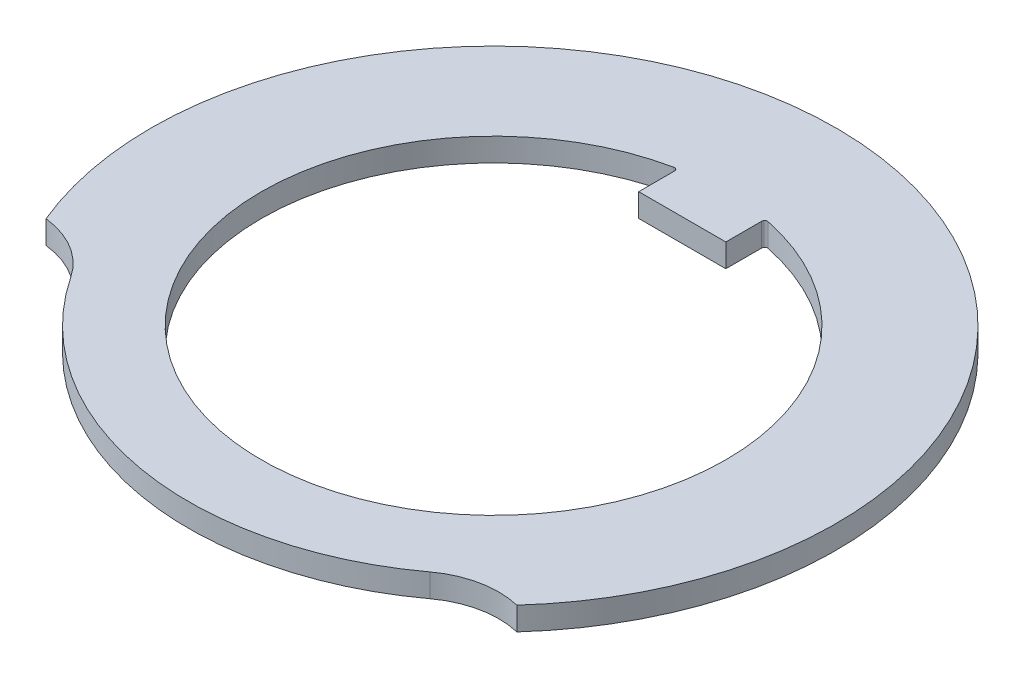
ISO-10303-21;
HEADER;
FILE_DESCRIPTION(('STEP AP214'),'2;1');
FILE_NAME('part.step','',(''),(''),'','','');
FILE_SCHEMA(('AUTOMOTIVE_DESIGN { 1 0 10303 214 1 1 1 1 }'));
ENDSEC;
DATA;
#1=APPLICATION_CONTEXT('core data for automotive mechanical design processes');
#2=APPLICATION_PROTOCOL_DEFINITION('international standard','automotive_design',2000,#1);
#3=PRODUCT_CONTEXT('',#1,'mechanical');
#4=PRODUCT('Part','Part','',(#3));
#5=PRODUCT_RELATED_PRODUCT_CATEGORY('part','',(#4));
#6=PRODUCT_DEFINITION_FORMATION('','',#4);
#7=PRODUCT_DEFINITION_CONTEXT('part definition',#1,'design');
#8=PRODUCT_DEFINITION('design','',#6,#7);
#9=PRODUCT_DEFINITION_SHAPE('','',#8);
#10=(LENGTH_UNIT() NAMED_UNIT(*) SI_UNIT(.MILLI.,.METRE.));
#11=(NAMED_UNIT(*) PLANE_ANGLE_UNIT() SI_UNIT($,.RADIAN.));
#12=(NAMED_UNIT(*) SI_UNIT($,.STERADIAN.) SOLID_ANGLE_UNIT());
#13=UNCERTAINTY_MEASURE_WITH_UNIT(LENGTH_MEASURE(1.E-05),#10,'distance_accuracy_value','');
#14=(GEOMETRIC_REPRESENTATION_CONTEXT(3) GLOBAL_UNCERTAINTY_ASSIGNED_CONTEXT((#13)) GLOBAL_UNIT_ASSIGNED_CONTEXT((#10,
#11,#12)) REPRESENTATION_CONTEXT('',''));
#15=CARTESIAN_POINT('',(0.,0.,0.));
#16=DIRECTION('',(0.,0.,1.));
#17=DIRECTION('',(1.,0.,0.));
#18=AXIS2_PLACEMENT_3D('',#15,#16,#17);
#19=CARTESIAN_POINT('',(4.01608518306673,0.8,5.42527048195312));
#20=DIRECTION('',(0.,-1.,0.));
#21=DIRECTION('',(0.,0.,-1.));
#22=AXIS2_PLACEMENT_3D('',#19,#20,#21);
#23=PLANE('',#22);
#24=CARTESIAN_POINT('',(8.03217036613347,0.8,10.8505409639062));
#25=DIRECTION('',(0.,-1.,0.));
#26=DIRECTION('',(0.,0.,-1.));
#27=AXIS2_PLACEMENT_3D('',#24,#25,#26);
#28=CIRCLE('',#27,3.);
#29=CARTESIAN_POINT('',(6.24724361810381,0.8,8.43930963859375));
#30=VERTEX_POINT('',#29);
#31=CARTESIAN_POINT('',(8.73457390434464,0.8,7.93392832772906));
#32=VERTEX_POINT('',#31);
#33=EDGE_CURVE('E149',#30,#32,#28,.T.);
#34=ORIENTED_EDGE('',*,*,#33,.T.);
#35=CARTESIAN_POINT('',(0.,0.8,0.));
#36=DIRECTION('',(0.,1.,0.));
#37=DIRECTION('',(0.,0.,1.));
#38=AXIS2_PLACEMENT_3D('',#35,#36,#37);
#39=CIRCLE('',#38,11.8);
#40=CARTESIAN_POINT('',(-10.9017784836332,0.8,4.51566450190802));
#41=VERTEX_POINT('',#40);
#42=EDGE_CURVE('E152',#32,#41,#39,.T.);
#43=ORIENTED_EDGE('',*,*,#42,.T.);
#44=CARTESIAN_POINT('',(-11.2262652901416,0.8,7.49806425921791));
#45=DIRECTION('',(0.,-1.,0.));
#46=DIRECTION('',(0.,0.,-1.));
#47=AXIS2_PLACEMENT_3D('',#44,#45,#46);
#48=CIRCLE('',#47,3.);
#49=CARTESIAN_POINT('',(-8.73153967011016,0.8,5.83182775716948));
#50=VERTEX_POINT('',#49);
#51=EDGE_CURVE('E155',#41,#50,#48,.T.);
#52=ORIENTED_EDGE('',*,*,#51,.T.);
#53=CARTESIAN_POINT('',(0.,0.8,0.));
#54=DIRECTION('',(0.,1.,0.));
#55=DIRECTION('',(0.,0.,1.));
#56=AXIS2_PLACEMENT_3D('',#53,#54,#55);
#57=CIRCLE('',#56,10.5);
#58=EDGE_CURVE('E157',#50,#30,#57,.T.);
#59=ORIENTED_EDGE('',*,*,#58,.T.);
#60=EDGE_LOOP('',(#34,#43,#52,#59));
#61=FACE_BOUND('',#60,.T.);
#62=DIRECTION('',(0.,0.,-1.));
#63=VECTOR('',#62,1.);
#64=CARTESIAN_POINT('',(-1.5,0.8,-6.5));
#65=LINE('',#64,#63);
#66=CARTESIAN_POINT('',(-1.5,0.8,-6.5));
#67=VERTEX_POINT('',#66);
#68=CARTESIAN_POINT('',(-1.5,0.8,-7.73627817493658));
#69=VERTEX_POINT('',#68);
#70=EDGE_CURVE('E126',#67,#69,#65,.T.);
#71=ORIENTED_EDGE('',*,*,#70,.F.);
#72=DIRECTION('',(-1.,0.,0.));
#73=VECTOR('',#72,1.);
#74=CARTESIAN_POINT('',(-1.5,0.8,-6.5));
#75=LINE('',#74,#73);
#76=CARTESIAN_POINT('',(1.5,0.8,-6.5));
#77=VERTEX_POINT('',#76);
#78=EDGE_CURVE('E110',#77,#67,#75,.T.);
#79=ORIENTED_EDGE('',*,*,#78,.F.);
#80=DIRECTION('',(0.,0.,1.));
#81=VECTOR('',#80,1.);
#82=CARTESIAN_POINT('',(1.5,0.8,-6.5));
#83=LINE('',#82,#81);
#84=CARTESIAN_POINT('',(1.5,0.8,-7.73627817493658));
#85=VERTEX_POINT('',#84);
#86=EDGE_CURVE('E120',#85,#77,#83,.T.);
#87=ORIENTED_EDGE('',*,*,#86,.F.);
#88=CARTESIAN_POINT('',(1.6,0.8,-7.73627817493658));
#89=DIRECTION('',(0.,-1.,0.));
#90=DIRECTION('',(0.,0.,-1.));
#91=AXIS2_PLACEMENT_3D('',#88,#89,#90);
#92=CIRCLE('',#91,0.1);
#93=CARTESIAN_POINT('',(1.62025316455696,0.8,-7.83420574677122));
#94=VERTEX_POINT('',#93);
#95=EDGE_CURVE('E11',#85,#94,#92,.T.);
#96=ORIENTED_EDGE('',*,*,#95,.T.);
#97=CARTESIAN_POINT('',(0.,0.8,0.));
#98=DIRECTION('',(0.,1.,0.));
#99=DIRECTION('',(0.,0.,1.));
#100=AXIS2_PLACEMENT_3D('',#97,#98,#99);
#101=CIRCLE('',#100,8.);
#102=CARTESIAN_POINT('',(-1.62025316455696,0.8,-7.83420574677122));
#103=VERTEX_POINT('',#102);
#104=EDGE_CURVE('E134',#103,#94,#101,.T.);
#105=ORIENTED_EDGE('',*,*,#104,.F.);
#106=CARTESIAN_POINT('',(-1.6,0.8,-7.73627817493658));
#107=DIRECTION('',(0.,-1.,0.));
#108=DIRECTION('',(0.,0.,-1.));
#109=AXIS2_PLACEMENT_3D('',#106,#107,#108);
#110=CIRCLE('',#109,0.1);
#111=EDGE_CURVE('E133',#103,#69,#110,.T.);
#112=ORIENTED_EDGE('',*,*,#111,.T.);
#113=EDGE_LOOP('',(#71,#79,#87,#96,#105,#112));
#114=FACE_BOUND('',#113,.T.);
#115=ADVANCED_FACE('F34',(#61,#114),#23,.F.);
#116=CARTESIAN_POINT('',(4.01608518306673,0.,5.42527048195312));
#117=DIRECTION('',(0.,-1.,0.));
#118=DIRECTION('',(0.,0.,-1.));
#119=AXIS2_PLACEMENT_3D('',#116,#117,#118);
#120=PLANE('',#119);
#121=CARTESIAN_POINT('',(8.03217036613347,0.,10.8505409639062));
#122=DIRECTION('',(0.,-1.,0.));
#123=DIRECTION('',(0.,0.,-1.));
#124=AXIS2_PLACEMENT_3D('',#121,#122,#123);
#125=CIRCLE('',#124,3.);
#126=CARTESIAN_POINT('',(6.24724361810381,0.,8.43930963859375));
#127=VERTEX_POINT('',#126);
#128=CARTESIAN_POINT('',(8.73457390434464,0.,7.93392832772906));
#129=VERTEX_POINT('',#128);
#130=EDGE_CURVE('E148',#127,#129,#125,.T.);
#131=ORIENTED_EDGE('',*,*,#130,.F.);
#132=CARTESIAN_POINT('',(0.,0.,0.));
#133=DIRECTION('',(0.,1.,0.));
#134=DIRECTION('',(0.,0.,1.));
#135=AXIS2_PLACEMENT_3D('',#132,#133,#134);
#136=CIRCLE('',#135,10.5);
#137=CARTESIAN_POINT('',(-8.73153967011016,0.,5.83182775716948));
#138=VERTEX_POINT('',#137);
#139=EDGE_CURVE('E153',#138,#127,#136,.T.);
#140=ORIENTED_EDGE('',*,*,#139,.F.);
#141=CARTESIAN_POINT('',(-11.2262652901416,0.,7.49806425921791));
#142=DIRECTION('',(0.,-1.,0.));
#143=DIRECTION('',(0.,0.,-1.));
#144=AXIS2_PLACEMENT_3D('',#141,#142,#143);
#145=CIRCLE('',#144,3.);
#146=CARTESIAN_POINT('',(-10.9017784836332,0.,4.51566450190802));
#147=VERTEX_POINT('',#146);
#148=EDGE_CURVE('E164',#147,#138,#145,.T.);
#149=ORIENTED_EDGE('',*,*,#148,.F.);
#150=CARTESIAN_POINT('',(0.,0.,0.));
#151=DIRECTION('',(0.,1.,0.));
#152=DIRECTION('',(0.,0.,1.));
#153=AXIS2_PLACEMENT_3D('',#150,#151,#152);
#154=CIRCLE('',#153,11.8);
#155=EDGE_CURVE('E162',#129,#147,#154,.T.);
#156=ORIENTED_EDGE('',*,*,#155,.F.);
#157=EDGE_LOOP('',(#131,#140,#149,#156));
#158=FACE_BOUND('',#157,.T.);
#159=DIRECTION('',(-1.,0.,0.));
#160=VECTOR('',#159,1.);
#161=CARTESIAN_POINT('',(-1.5,0.,-6.5));
#162=LINE('',#161,#160);
#163=CARTESIAN_POINT('',(1.5,0.,-6.5));
#164=VERTEX_POINT('',#163);
#165=CARTESIAN_POINT('',(-1.5,0.,-6.5));
#166=VERTEX_POINT('',#165);
#167=EDGE_CURVE('E135',#164,#166,#162,.T.);
#168=ORIENTED_EDGE('',*,*,#167,.T.);
#169=DIRECTION('',(0.,0.,-1.));
#170=VECTOR('',#169,1.);
#171=CARTESIAN_POINT('',(-1.5,0.,-6.5));
#172=LINE('',#171,#170);
#173=CARTESIAN_POINT('',(-1.5,0.,-7.73627817493658));
#174=VERTEX_POINT('',#173);
#175=EDGE_CURVE('E129',#166,#174,#172,.T.);
#176=ORIENTED_EDGE('',*,*,#175,.T.);
#177=CARTESIAN_POINT('',(-1.6,0.,-7.73627817493658));
#178=DIRECTION('',(0.,-1.,0.));
#179=DIRECTION('',(0.,0.,-1.));
#180=AXIS2_PLACEMENT_3D('',#177,#178,#179);
#181=CIRCLE('',#180,0.1);
#182=CARTESIAN_POINT('',(-1.62025316455696,0.,-7.83420574677122));
#183=VERTEX_POINT('',#182);
#184=EDGE_CURVE('E186',#174,#183,#181,.F.);
#185=ORIENTED_EDGE('',*,*,#184,.T.);
#186=CARTESIAN_POINT('',(0.,0.,0.));
#187=DIRECTION('',(0.,1.,0.));
#188=DIRECTION('',(0.,0.,1.));
#189=AXIS2_PLACEMENT_3D('',#186,#187,#188);
#190=CIRCLE('',#189,8.);
#191=CARTESIAN_POINT('',(1.62025316455696,0.,-7.83420574677122));
#192=VERTEX_POINT('',#191);
#193=EDGE_CURVE('E144',#183,#192,#190,.T.);
#194=ORIENTED_EDGE('',*,*,#193,.T.);
#195=CARTESIAN_POINT('',(1.6,0.,-7.73627817493658));
#196=DIRECTION('',(0.,-1.,0.));
#197=DIRECTION('',(0.,0.,-1.));
#198=AXIS2_PLACEMENT_3D('',#195,#196,#197);
#199=CIRCLE('',#198,0.1);
#200=CARTESIAN_POINT('',(1.5,0.,-7.73627817493658));
#201=VERTEX_POINT('',#200);
#202=EDGE_CURVE('E42',#192,#201,#199,.F.);
#203=ORIENTED_EDGE('',*,*,#202,.T.);
#204=DIRECTION('',(0.,0.,1.));
#205=VECTOR('',#204,1.);
#206=CARTESIAN_POINT('',(1.5,0.,-6.5));
#207=LINE('',#206,#205);
#208=EDGE_CURVE('E139',#201,#164,#207,.T.);
#209=ORIENTED_EDGE('',*,*,#208,.T.);
#210=EDGE_LOOP('',(#168,#176,#185,#194,#203,#209));
#211=FACE_BOUND('',#210,.T.);
#212=ADVANCED_FACE('F189',(#158,#211),#120,.T.);
#213=CARTESIAN_POINT('',(8.03217036613347,0.8,10.8505409639062));
#214=DIRECTION('',(0.,-1.,0.));
#215=DIRECTION('',(0.,0.,-1.));
#216=AXIS2_PLACEMENT_3D('',#213,#214,#215);
#217=CYLINDRICAL_SURFACE('',#216,3.);
#218=ORIENTED_EDGE('',*,*,#130,.T.);
#219=DIRECTION('',(0.,-1.,0.));
#220=VECTOR('',#219,1.);
#221=CARTESIAN_POINT('',(8.73457390434464,0.8,7.93392832772906));
#222=LINE('',#221,#220);
#223=EDGE_CURVE('E175',#32,#129,#222,.T.);
#224=ORIENTED_EDGE('',*,*,#223,.F.);
#225=ORIENTED_EDGE('',*,*,#33,.F.);
#226=DIRECTION('',(0.,-1.,0.));
#227=VECTOR('',#226,1.);
#228=CARTESIAN_POINT('',(6.24724361810381,0.8,8.43930963859375));
#229=LINE('',#228,#227);
#230=EDGE_CURVE('E159',#30,#127,#229,.T.);
#231=ORIENTED_EDGE('',*,*,#230,.T.);
#232=EDGE_LOOP('',(#218,#224,#225,#231));
#233=FACE_BOUND('',#232,.T.);
#234=ADVANCED_FACE('F211',(#233),#217,.F.);
#235=CARTESIAN_POINT('',(0.,0.8,0.));
#236=DIRECTION('',(0.,-1.,0.));
#237=DIRECTION('',(0.,0.,-1.));
#238=AXIS2_PLACEMENT_3D('',#235,#236,#237);
#239=CYLINDRICAL_SURFACE('',#238,11.8);
#240=ORIENTED_EDGE('',*,*,#155,.T.);
#241=DIRECTION('',(0.,-1.,0.));
#242=VECTOR('',#241,1.);
#243=CARTESIAN_POINT('',(-10.9017784836332,0.8,4.51566450190802));
#244=LINE('',#243,#242);
#245=EDGE_CURVE('E172',#41,#147,#244,.T.);
#246=ORIENTED_EDGE('',*,*,#245,.F.);
#247=ORIENTED_EDGE('',*,*,#42,.F.);
#248=ORIENTED_EDGE('',*,*,#223,.T.);
#249=EDGE_LOOP('',(#240,#246,#247,#248));
#250=FACE_BOUND('',#249,.T.);
#251=ADVANCED_FACE('F224',(#250),#239,.T.);
#252=CARTESIAN_POINT('',(-11.2262652901416,0.8,7.49806425921791));
#253=DIRECTION('',(0.,-1.,0.));
#254=DIRECTION('',(0.,0.,-1.));
#255=AXIS2_PLACEMENT_3D('',#252,#253,#254);
#256=CYLINDRICAL_SURFACE('',#255,3.);
#257=ORIENTED_EDGE('',*,*,#148,.T.);
#258=DIRECTION('',(0.,-1.,0.));
#259=VECTOR('',#258,1.);
#260=CARTESIAN_POINT('',(-8.73153967011016,0.8,5.83182775716948));
#261=LINE('',#260,#259);
#262=EDGE_CURVE('E169',#50,#138,#261,.T.);
#263=ORIENTED_EDGE('',*,*,#262,.F.);
#264=ORIENTED_EDGE('',*,*,#51,.F.);
#265=ORIENTED_EDGE('',*,*,#245,.T.);
#266=EDGE_LOOP('',(#257,#263,#264,#265));
#267=FACE_BOUND('',#266,.T.);
#268=ADVANCED_FACE('F220',(#267),#256,.F.);
#269=CARTESIAN_POINT('',(0.,0.8,0.));
#270=DIRECTION('',(0.,-1.,0.));
#271=DIRECTION('',(0.,0.,-1.));
#272=AXIS2_PLACEMENT_3D('',#269,#270,#271);
#273=CYLINDRICAL_SURFACE('',#272,10.5);
#274=ORIENTED_EDGE('',*,*,#139,.T.);
#275=ORIENTED_EDGE('',*,*,#230,.F.);
#276=ORIENTED_EDGE('',*,*,#58,.F.);
#277=ORIENTED_EDGE('',*,*,#262,.T.);
#278=EDGE_LOOP('',(#274,#275,#276,#277));
#279=FACE_BOUND('',#278,.T.);
#280=ADVANCED_FACE('F217',(#279),#273,.T.);
#281=CARTESIAN_POINT('',(-1.5,0.8,-6.5));
#282=DIRECTION('',(-1.,0.,0.));
#283=DIRECTION('',(0.,0.,1.));
#284=AXIS2_PLACEMENT_3D('',#281,#282,#283);
#285=PLANE('',#284);
#286=ORIENTED_EDGE('',*,*,#70,.T.);
#287=DIRECTION('',(0.,1.,0.));
#288=VECTOR('',#287,1.);
#289=CARTESIAN_POINT('',(-1.5,0.,-7.73627817493658));
#290=LINE('',#289,#288);
#291=EDGE_CURVE('E178',#69,#174,#290,.F.);
#292=ORIENTED_EDGE('',*,*,#291,.T.);
#293=ORIENTED_EDGE('',*,*,#175,.F.);
#294=DIRECTION('',(0.,-1.,0.));
#295=VECTOR('',#294,1.);
#296=CARTESIAN_POINT('',(-1.5,0.8,-6.5));
#297=LINE('',#296,#295);
#298=EDGE_CURVE('E114',#67,#166,#297,.T.);
#299=ORIENTED_EDGE('',*,*,#298,.F.);
#300=EDGE_LOOP('',(#286,#292,#293,#299));
#301=FACE_BOUND('',#300,.T.);
#302=ADVANCED_FACE('F124',(#301),#285,.T.);
#303=CARTESIAN_POINT('',(0.,0.8,0.));
#304=DIRECTION('',(0.,-1.,0.));
#305=DIRECTION('',(0.,0.,-1.));
#306=AXIS2_PLACEMENT_3D('',#303,#304,#305);
#307=CYLINDRICAL_SURFACE('',#306,8.);
#308=ORIENTED_EDGE('',*,*,#193,.F.);
#309=DIRECTION('',(0.,-1.,0.));
#310=VECTOR('',#309,1.);
#311=CARTESIAN_POINT('',(-1.62025316455696,0.8,-7.83420574677122));
#312=LINE('',#311,#310);
#313=EDGE_CURVE('E183',#183,#103,#312,.F.);
#314=ORIENTED_EDGE('',*,*,#313,.T.);
#315=ORIENTED_EDGE('',*,*,#104,.T.);
#316=DIRECTION('',(0.,-1.,0.));
#317=VECTOR('',#316,1.);
#318=CARTESIAN_POINT('',(1.62025316455696,0.8,-7.83420574677122));
#319=LINE('',#318,#317);
#320=EDGE_CURVE('E180',#94,#192,#319,.T.);
#321=ORIENTED_EDGE('',*,*,#320,.T.);
#322=EDGE_LOOP('',(#308,#314,#315,#321));
#323=FACE_BOUND('',#322,.T.);
#324=ADVANCED_FACE('F193',(#323),#307,.F.);
#325=CARTESIAN_POINT('',(1.5,0.8,-6.5));
#326=DIRECTION('',(1.,0.,0.));
#327=DIRECTION('',(0.,0.,-1.));
#328=AXIS2_PLACEMENT_3D('',#325,#326,#327);
#329=PLANE('',#328);
#330=ORIENTED_EDGE('',*,*,#208,.F.);
#331=DIRECTION('',(0.,1.,0.));
#332=VECTOR('',#331,1.);
#333=CARTESIAN_POINT('',(1.5,0.8,-7.73627817493658));
#334=LINE('',#333,#332);
#335=EDGE_CURVE('E49',#201,#85,#334,.T.);
#336=ORIENTED_EDGE('',*,*,#335,.T.);
#337=ORIENTED_EDGE('',*,*,#86,.T.);
#338=DIRECTION('',(0.,-1.,0.));
#339=VECTOR('',#338,1.);
#340=CARTESIAN_POINT('',(1.5,0.8,-6.5));
#341=LINE('',#340,#339);
#342=EDGE_CURVE('E117',#77,#164,#341,.T.);
#343=ORIENTED_EDGE('',*,*,#342,.T.);
#344=EDGE_LOOP('',(#330,#336,#337,#343));
#345=FACE_BOUND('',#344,.T.);
#346=ADVANCED_FACE('F202',(#345),#329,.T.);
#347=CARTESIAN_POINT('',(-1.5,0.8,-6.5));
#348=DIRECTION('',(0.,0.,1.));
#349=DIRECTION('',(1.,0.,0.));
#350=AXIS2_PLACEMENT_3D('',#347,#348,#349);
#351=PLANE('',#350);
#352=ORIENTED_EDGE('',*,*,#167,.F.);
#353=ORIENTED_EDGE('',*,*,#342,.F.);
#354=ORIENTED_EDGE('',*,*,#78,.T.);
#355=ORIENTED_EDGE('',*,*,#298,.T.);
#356=EDGE_LOOP('',(#352,#353,#354,#355));
#357=FACE_BOUND('',#356,.T.);
#358=ADVANCED_FACE('F113',(#357),#351,.T.);
#359=CARTESIAN_POINT('',(-1.6,0.8,-7.73627817493658));
#360=DIRECTION('',(0.,-1.,0.));
#361=DIRECTION('',(0.,0.,-1.));
#362=AXIS2_PLACEMENT_3D('',#359,#360,#361);
#363=CYLINDRICAL_SURFACE('',#362,0.1);
#364=ORIENTED_EDGE('',*,*,#111,.F.);
#365=ORIENTED_EDGE('',*,*,#313,.F.);
#366=ORIENTED_EDGE('',*,*,#184,.F.);
#367=ORIENTED_EDGE('',*,*,#291,.F.);
#368=EDGE_LOOP('',(#364,#365,#366,#367));
#369=FACE_BOUND('',#368,.T.);
#370=ADVANCED_FACE('F195',(#369),#363,.F.);
#371=CARTESIAN_POINT('',(1.6,0.8,-7.73627817493658));
#372=DIRECTION('',(0.,-1.,0.));
#373=DIRECTION('',(0.,0.,-1.));
#374=AXIS2_PLACEMENT_3D('',#371,#372,#373);
#375=CYLINDRICAL_SURFACE('',#374,0.1);
#376=ORIENTED_EDGE('',*,*,#95,.F.);
#377=ORIENTED_EDGE('',*,*,#335,.F.);
#378=ORIENTED_EDGE('',*,*,#202,.F.);
#379=ORIENTED_EDGE('',*,*,#320,.F.);
#380=EDGE_LOOP('',(#376,#377,#378,#379));
#381=FACE_BOUND('',#380,.T.);
#382=ADVANCED_FACE('F36',(#381),#375,.F.);
#383=CLOSED_SHELL('',(#115,#212,#234,#251,#268,#280,#302,#324,#346,#358,#370,#382));
#384=MANIFOLD_SOLID_BREP('B2',#383);
#385=ADVANCED_BREP_SHAPE_REPRESENTATION('',(#18,#384),#14);
#386=SHAPE_DEFINITION_REPRESENTATION(#9,#385);
ENDSEC;
END-ISO-10303-21;
